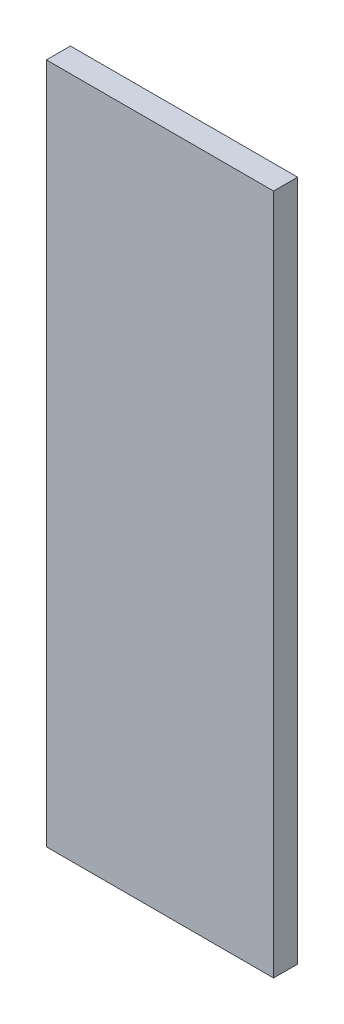
ISO-10303-21;
HEADER;
FILE_DESCRIPTION(('STEP AP214'),'2;1');
FILE_NAME('part.step','',(''),(''),'','','');
FILE_SCHEMA(('AUTOMOTIVE_DESIGN { 1 0 10303 214 1 1 1 1 }'));
ENDSEC;
DATA;
#1=APPLICATION_CONTEXT('core data for automotive mechanical design processes');
#2=APPLICATION_PROTOCOL_DEFINITION('international standard','automotive_design',2000,#1);
#3=PRODUCT_CONTEXT('',#1,'mechanical');
#4=PRODUCT('Part','Part','',(#3));
#5=PRODUCT_RELATED_PRODUCT_CATEGORY('part','',(#4));
#6=PRODUCT_DEFINITION_FORMATION('','',#4);
#7=PRODUCT_DEFINITION_CONTEXT('part definition',#1,'design');
#8=PRODUCT_DEFINITION('design','',#6,#7);
#9=PRODUCT_DEFINITION_SHAPE('','',#8);
#10=(LENGTH_UNIT() NAMED_UNIT(*) SI_UNIT(.MILLI.,.METRE.));
#11=(NAMED_UNIT(*) PLANE_ANGLE_UNIT() SI_UNIT($,.RADIAN.));
#12=(NAMED_UNIT(*) SI_UNIT($,.STERADIAN.) SOLID_ANGLE_UNIT());
#13=UNCERTAINTY_MEASURE_WITH_UNIT(LENGTH_MEASURE(1.E-05),#10,'distance_accuracy_value','');
#14=(GEOMETRIC_REPRESENTATION_CONTEXT(3) GLOBAL_UNCERTAINTY_ASSIGNED_CONTEXT((#13)) GLOBAL_UNIT_ASSIGNED_CONTEXT((#10,
#11,#12)) REPRESENTATION_CONTEXT('',''));
#15=CARTESIAN_POINT('',(0.,0.,0.));
#16=DIRECTION('',(0.,0.,1.));
#17=DIRECTION('',(1.,0.,0.));
#18=AXIS2_PLACEMENT_3D('',#15,#16,#17);
#19=CARTESIAN_POINT('',(-15.,-45.,3.175));
#20=DIRECTION('',(1.,0.,0.));
#21=DIRECTION('',(0.,0.,-1.));
#22=AXIS2_PLACEMENT_3D('',#19,#20,#21);
#23=PLANE('',#22);
#24=DIRECTION('',(0.,-1.,0.));
#25=VECTOR('',#24,1.);
#26=CARTESIAN_POINT('',(-15.,-45.,0.));
#27=LINE('',#26,#25);
#28=CARTESIAN_POINT('',(-15.,45.,0.));
#29=VERTEX_POINT('',#28);
#30=CARTESIAN_POINT('',(-15.,-45.,0.));
#31=VERTEX_POINT('',#30);
#32=EDGE_CURVE('E96',#29,#31,#27,.T.);
#33=ORIENTED_EDGE('',*,*,#32,.T.);
#34=DIRECTION('',(0.,0.,-1.));
#35=VECTOR('',#34,1.);
#36=CARTESIAN_POINT('',(-15.,-45.,3.175));
#37=LINE('',#36,#35);
#38=CARTESIAN_POINT('',(-15.,-45.,3.175));
#39=VERTEX_POINT('',#38);
#40=EDGE_CURVE('E11',#39,#31,#37,.T.);
#41=ORIENTED_EDGE('',*,*,#40,.F.);
#42=DIRECTION('',(0.,-1.,0.));
#43=VECTOR('',#42,1.);
#44=CARTESIAN_POINT('',(-15.,-45.,3.175));
#45=LINE('',#44,#43);
#46=CARTESIAN_POINT('',(-15.,45.,3.175));
#47=VERTEX_POINT('',#46);
#48=EDGE_CURVE('E84',#47,#39,#45,.T.);
#49=ORIENTED_EDGE('',*,*,#48,.F.);
#50=DIRECTION('',(0.,0.,-1.));
#51=VECTOR('',#50,1.);
#52=CARTESIAN_POINT('',(-15.,45.,3.175));
#53=LINE('',#52,#51);
#54=EDGE_CURVE('E92',#47,#29,#53,.T.);
#55=ORIENTED_EDGE('',*,*,#54,.T.);
#56=EDGE_LOOP('',(#33,#41,#49,#55));
#57=FACE_BOUND('',#56,.T.);
#58=ADVANCED_FACE('F33',(#57),#23,.F.);
#59=CARTESIAN_POINT('',(15.,-45.,3.175));
#60=DIRECTION('',(0.,1.,0.));
#61=DIRECTION('',(0.,0.,1.));
#62=AXIS2_PLACEMENT_3D('',#59,#60,#61);
#63=PLANE('',#62);
#64=DIRECTION('',(1.,0.,0.));
#65=VECTOR('',#64,1.);
#66=CARTESIAN_POINT('',(15.,-45.,0.));
#67=LINE('',#66,#65);
#68=CARTESIAN_POINT('',(15.,-45.,0.));
#69=VERTEX_POINT('',#68);
#70=EDGE_CURVE('E88',#31,#69,#67,.T.);
#71=ORIENTED_EDGE('',*,*,#70,.T.);
#72=DIRECTION('',(0.,0.,-1.));
#73=VECTOR('',#72,1.);
#74=CARTESIAN_POINT('',(15.,-45.,3.175));
#75=LINE('',#74,#73);
#76=CARTESIAN_POINT('',(15.,-45.,3.175));
#77=VERTEX_POINT('',#76);
#78=EDGE_CURVE('E41',#77,#69,#75,.T.);
#79=ORIENTED_EDGE('',*,*,#78,.F.);
#80=DIRECTION('',(1.,0.,0.));
#81=VECTOR('',#80,1.);
#82=CARTESIAN_POINT('',(15.,-45.,3.175));
#83=LINE('',#82,#81);
#84=EDGE_CURVE('E79',#39,#77,#83,.T.);
#85=ORIENTED_EDGE('',*,*,#84,.F.);
#86=ORIENTED_EDGE('',*,*,#40,.T.);
#87=EDGE_LOOP('',(#71,#79,#85,#86));
#88=FACE_BOUND('',#87,.T.);
#89=ADVANCED_FACE('F87',(#88),#63,.F.);
#90=CARTESIAN_POINT('',(15.,-45.,3.175));
#91=DIRECTION('',(-1.,0.,0.));
#92=DIRECTION('',(0.,0.,1.));
#93=AXIS2_PLACEMENT_3D('',#90,#91,#92);
#94=PLANE('',#93);
#95=DIRECTION('',(0.,1.,0.));
#96=VECTOR('',#95,1.);
#97=CARTESIAN_POINT('',(15.,-45.,0.));
#98=LINE('',#97,#96);
#99=CARTESIAN_POINT('',(15.,45.,0.));
#100=VERTEX_POINT('',#99);
#101=EDGE_CURVE('E66',#69,#100,#98,.T.);
#102=ORIENTED_EDGE('',*,*,#101,.T.);
#103=DIRECTION('',(0.,0.,-1.));
#104=VECTOR('',#103,1.);
#105=CARTESIAN_POINT('',(15.,45.,3.175));
#106=LINE('',#105,#104);
#107=CARTESIAN_POINT('',(15.,45.,3.175));
#108=VERTEX_POINT('',#107);
#109=EDGE_CURVE('E89',#108,#100,#106,.T.);
#110=ORIENTED_EDGE('',*,*,#109,.F.);
#111=DIRECTION('',(0.,1.,0.));
#112=VECTOR('',#111,1.);
#113=CARTESIAN_POINT('',(15.,-45.,3.175));
#114=LINE('',#113,#112);
#115=EDGE_CURVE('E82',#77,#108,#114,.T.);
#116=ORIENTED_EDGE('',*,*,#115,.F.);
#117=ORIENTED_EDGE('',*,*,#78,.T.);
#118=EDGE_LOOP('',(#102,#110,#116,#117));
#119=FACE_BOUND('',#118,.T.);
#120=ADVANCED_FACE('F90',(#119),#94,.F.);
#121=CARTESIAN_POINT('',(15.,45.,3.175));
#122=DIRECTION('',(0.,-1.,0.));
#123=DIRECTION('',(0.,0.,-1.));
#124=AXIS2_PLACEMENT_3D('',#121,#122,#123);
#125=PLANE('',#124);
#126=DIRECTION('',(-1.,0.,0.));
#127=VECTOR('',#126,1.);
#128=CARTESIAN_POINT('',(15.,45.,0.));
#129=LINE('',#128,#127);
#130=EDGE_CURVE('E72',#100,#29,#129,.T.);
#131=ORIENTED_EDGE('',*,*,#130,.T.);
#132=ORIENTED_EDGE('',*,*,#54,.F.);
#133=DIRECTION('',(-1.,0.,0.));
#134=VECTOR('',#133,1.);
#135=CARTESIAN_POINT('',(15.,45.,3.175));
#136=LINE('',#135,#134);
#137=EDGE_CURVE('E49',#108,#47,#136,.T.);
#138=ORIENTED_EDGE('',*,*,#137,.F.);
#139=ORIENTED_EDGE('',*,*,#109,.T.);
#140=EDGE_LOOP('',(#131,#132,#138,#139));
#141=FACE_BOUND('',#140,.T.);
#142=ADVANCED_FACE('F103',(#141),#125,.F.);
#143=CARTESIAN_POINT('',(0.,0.,3.175));
#144=DIRECTION('',(0.,0.,1.));
#145=DIRECTION('',(1.,0.,0.));
#146=AXIS2_PLACEMENT_3D('',#143,#144,#145);
#147=PLANE('',#146);
#148=ORIENTED_EDGE('',*,*,#48,.T.);
#149=ORIENTED_EDGE('',*,*,#84,.T.);
#150=ORIENTED_EDGE('',*,*,#115,.T.);
#151=ORIENTED_EDGE('',*,*,#137,.T.);
#152=EDGE_LOOP('',(#148,#149,#150,#151));
#153=FACE_BOUND('',#152,.T.);
#154=ADVANCED_FACE('F80',(#153),#147,.T.);
#155=CARTESIAN_POINT('',(0.,0.,0.));
#156=DIRECTION('',(0.,0.,1.));
#157=DIRECTION('',(1.,0.,0.));
#158=AXIS2_PLACEMENT_3D('',#155,#156,#157);
#159=PLANE('',#158);
#160=ORIENTED_EDGE('',*,*,#32,.F.);
#161=ORIENTED_EDGE('',*,*,#130,.F.);
#162=ORIENTED_EDGE('',*,*,#101,.F.);
#163=ORIENTED_EDGE('',*,*,#70,.F.);
#164=EDGE_LOOP('',(#160,#161,#162,#163));
#165=FACE_BOUND('',#164,.T.);
#166=ADVANCED_FACE('F106',(#165),#159,.F.);
#167=CLOSED_SHELL('',(#58,#89,#120,#142,#154,#166));
#168=MANIFOLD_SOLID_BREP('B2',#167);
#169=ADVANCED_BREP_SHAPE_REPRESENTATION('',(#18,#168),#14);
#170=SHAPE_DEFINITION_REPRESENTATION(#9,#169);
ENDSEC;
END-ISO-10303-21;
